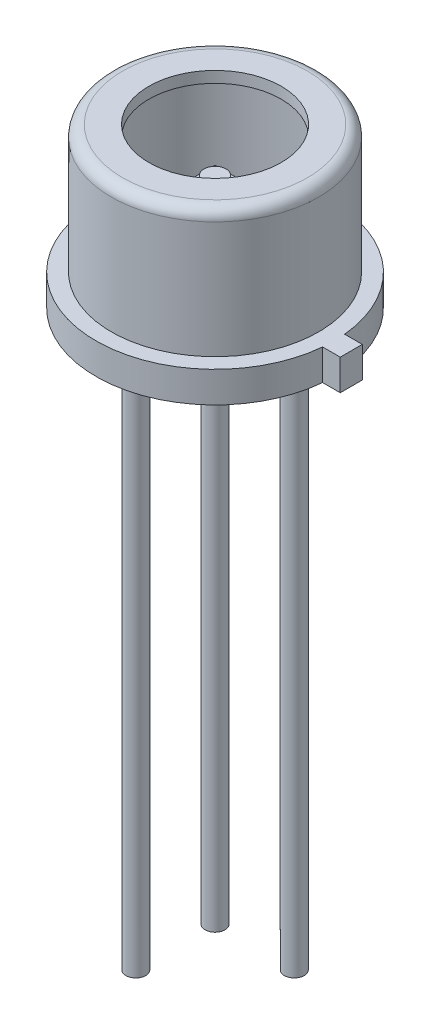
ISO-10303-21;
HEADER;
FILE_DESCRIPTION(('STEP AP214'),'2;1');
FILE_NAME('part.step','',(''),(''),'','','');
FILE_SCHEMA(('AUTOMOTIVE_DESIGN { 1 0 10303 214 1 1 1 1 }'));
ENDSEC;
DATA;
#1=APPLICATION_CONTEXT('core data for automotive mechanical design processes');
#2=APPLICATION_PROTOCOL_DEFINITION('international standard','automotive_design',2000,#1);
#3=PRODUCT_CONTEXT('',#1,'mechanical');
#4=PRODUCT('Part','Part','',(#3));
#5=PRODUCT_RELATED_PRODUCT_CATEGORY('part','',(#4));
#6=PRODUCT_DEFINITION_FORMATION('','',#4);
#7=PRODUCT_DEFINITION_CONTEXT('part definition',#1,'design');
#8=PRODUCT_DEFINITION('design','',#6,#7);
#9=PRODUCT_DEFINITION_SHAPE('','',#8);
#10=(LENGTH_UNIT() NAMED_UNIT(*) SI_UNIT(.MILLI.,.METRE.));
#11=(NAMED_UNIT(*) PLANE_ANGLE_UNIT() SI_UNIT($,.RADIAN.));
#12=(NAMED_UNIT(*) SI_UNIT($,.STERADIAN.) SOLID_ANGLE_UNIT());
#13=UNCERTAINTY_MEASURE_WITH_UNIT(LENGTH_MEASURE(1.E-05),#10,'distance_accuracy_value','');
#14=(GEOMETRIC_REPRESENTATION_CONTEXT(3) GLOBAL_UNCERTAINTY_ASSIGNED_CONTEXT((#13)) GLOBAL_UNIT_ASSIGNED_CONTEXT((#10,
#11,#12)) REPRESENTATION_CONTEXT('',''));
#15=CARTESIAN_POINT('',(0.,0.,0.));
#16=DIRECTION('',(0.,0.,1.));
#17=DIRECTION('',(1.,0.,0.));
#18=AXIS2_PLACEMENT_3D('',#15,#16,#17);
#19=CARTESIAN_POINT('',(-0.3,2.45,0.3));
#20=DIRECTION('',(1.,0.,0.));
#21=DIRECTION('',(0.,0.,-1.));
#22=AXIS2_PLACEMENT_3D('',#19,#20,#21);
#23=PLANE('',#22);
#24=DIRECTION('',(0.,0.,-1.));
#25=VECTOR('',#24,1.);
#26=CARTESIAN_POINT('',(-0.3,2.5,0.3));
#27=LINE('',#26,#25);
#28=CARTESIAN_POINT('',(-0.3,2.5,0.3));
#29=VERTEX_POINT('',#28);
#30=CARTESIAN_POINT('',(-0.299999999999999,2.5,-0.3));
#31=VERTEX_POINT('',#30);
#32=EDGE_CURVE('E110',#29,#31,#27,.T.);
#33=ORIENTED_EDGE('',*,*,#32,.T.);
#34=DIRECTION('',(0.,1.,0.));
#35=VECTOR('',#34,1.);
#36=CARTESIAN_POINT('',(-0.299999999999999,2.45,-0.3));
#37=LINE('',#36,#35);
#38=CARTESIAN_POINT('',(-0.299999999999999,2.45,-0.3));
#39=VERTEX_POINT('',#38);
#40=EDGE_CURVE('E12',#39,#31,#37,.T.);
#41=ORIENTED_EDGE('',*,*,#40,.F.);
#42=DIRECTION('',(0.,0.,-1.));
#43=VECTOR('',#42,1.);
#44=CARTESIAN_POINT('',(-0.3,2.45,0.3));
#45=LINE('',#44,#43);
#46=CARTESIAN_POINT('',(-0.3,2.45,0.3));
#47=VERTEX_POINT('',#46);
#48=EDGE_CURVE('E98',#47,#39,#45,.T.);
#49=ORIENTED_EDGE('',*,*,#48,.F.);
#50=DIRECTION('',(0.,1.,0.));
#51=VECTOR('',#50,1.);
#52=CARTESIAN_POINT('',(-0.3,2.45,0.3));
#53=LINE('',#52,#51);
#54=EDGE_CURVE('E106',#47,#29,#53,.T.);
#55=ORIENTED_EDGE('',*,*,#54,.T.);
#56=EDGE_LOOP('',(#33,#41,#49,#55));
#57=FACE_BOUND('',#56,.T.);
#58=ADVANCED_FACE('F47',(#57),#23,.F.);
#59=CARTESIAN_POINT('',(-0.299999999999999,2.45,-0.3));
#60=DIRECTION('',(0.,0.,1.));
#61=DIRECTION('',(1.,0.,0.));
#62=AXIS2_PLACEMENT_3D('',#59,#60,#61);
#63=PLANE('',#62);
#64=DIRECTION('',(1.,0.,0.));
#65=VECTOR('',#64,1.);
#66=CARTESIAN_POINT('',(-0.299999999999999,2.5,-0.3));
#67=LINE('',#66,#65);
#68=CARTESIAN_POINT('',(0.3,2.5,-0.3));
#69=VERTEX_POINT('',#68);
#70=EDGE_CURVE('E102',#31,#69,#67,.T.);
#71=ORIENTED_EDGE('',*,*,#70,.T.);
#72=DIRECTION('',(0.,1.,0.));
#73=VECTOR('',#72,1.);
#74=CARTESIAN_POINT('',(0.3,2.45,-0.3));
#75=LINE('',#74,#73);
#76=CARTESIAN_POINT('',(0.3,2.45,-0.3));
#77=VERTEX_POINT('',#76);
#78=EDGE_CURVE('E55',#77,#69,#75,.T.);
#79=ORIENTED_EDGE('',*,*,#78,.F.);
#80=DIRECTION('',(1.,0.,0.));
#81=VECTOR('',#80,1.);
#82=CARTESIAN_POINT('',(-0.299999999999999,2.45,-0.3));
#83=LINE('',#82,#81);
#84=EDGE_CURVE('E93',#39,#77,#83,.T.);
#85=ORIENTED_EDGE('',*,*,#84,.F.);
#86=ORIENTED_EDGE('',*,*,#40,.T.);
#87=EDGE_LOOP('',(#71,#79,#85,#86));
#88=FACE_BOUND('',#87,.T.);
#89=ADVANCED_FACE('F101',(#88),#63,.F.);
#90=CARTESIAN_POINT('',(0.3,2.45,0.3));
#91=DIRECTION('',(-1.,0.,0.));
#92=DIRECTION('',(0.,0.,1.));
#93=AXIS2_PLACEMENT_3D('',#90,#91,#92);
#94=PLANE('',#93);
#95=DIRECTION('',(0.,0.,1.));
#96=VECTOR('',#95,1.);
#97=CARTESIAN_POINT('',(0.3,2.5,0.3));
#98=LINE('',#97,#96);
#99=CARTESIAN_POINT('',(0.3,2.5,0.3));
#100=VERTEX_POINT('',#99);
#101=EDGE_CURVE('E80',#69,#100,#98,.T.);
#102=ORIENTED_EDGE('',*,*,#101,.T.);
#103=DIRECTION('',(0.,1.,0.));
#104=VECTOR('',#103,1.);
#105=CARTESIAN_POINT('',(0.3,2.45,0.3));
#106=LINE('',#105,#104);
#107=CARTESIAN_POINT('',(0.3,2.45,0.3));
#108=VERTEX_POINT('',#107);
#109=EDGE_CURVE('E103',#108,#100,#106,.T.);
#110=ORIENTED_EDGE('',*,*,#109,.F.);
#111=DIRECTION('',(0.,0.,1.));
#112=VECTOR('',#111,1.);
#113=CARTESIAN_POINT('',(0.3,2.45,0.3));
#114=LINE('',#113,#112);
#115=EDGE_CURVE('E96',#77,#108,#114,.T.);
#116=ORIENTED_EDGE('',*,*,#115,.F.);
#117=ORIENTED_EDGE('',*,*,#78,.T.);
#118=EDGE_LOOP('',(#102,#110,#116,#117));
#119=FACE_BOUND('',#118,.T.);
#120=ADVANCED_FACE('F104',(#119),#94,.F.);
#121=CARTESIAN_POINT('',(-0.3,2.45,0.3));
#122=DIRECTION('',(0.,0.,-1.));
#123=DIRECTION('',(-1.,0.,0.));
#124=AXIS2_PLACEMENT_3D('',#121,#122,#123);
#125=PLANE('',#124);
#126=DIRECTION('',(-1.,0.,0.));
#127=VECTOR('',#126,1.);
#128=CARTESIAN_POINT('',(-0.3,2.5,0.3));
#129=LINE('',#128,#127);
#130=EDGE_CURVE('E86',#100,#29,#129,.T.);
#131=ORIENTED_EDGE('',*,*,#130,.T.);
#132=ORIENTED_EDGE('',*,*,#54,.F.);
#133=DIRECTION('',(-1.,0.,0.));
#134=VECTOR('',#133,1.);
#135=CARTESIAN_POINT('',(-0.3,2.45,0.3));
#136=LINE('',#135,#134);
#137=EDGE_CURVE('E63',#108,#47,#136,.T.);
#138=ORIENTED_EDGE('',*,*,#137,.F.);
#139=ORIENTED_EDGE('',*,*,#109,.T.);
#140=EDGE_LOOP('',(#131,#132,#138,#139));
#141=FACE_BOUND('',#140,.T.);
#142=ADVANCED_FACE('F118',(#141),#125,.F.);
#143=CARTESIAN_POINT('',(-0.299999999999999,2.45,-0.3));
#144=DIRECTION('',(0.,-1.,0.));
#145=DIRECTION('',(0.,0.,-1.));
#146=AXIS2_PLACEMENT_3D('',#143,#144,#145);
#147=PLANE('',#146);
#148=ORIENTED_EDGE('',*,*,#48,.T.);
#149=ORIENTED_EDGE('',*,*,#84,.T.);
#150=ORIENTED_EDGE('',*,*,#115,.T.);
#151=ORIENTED_EDGE('',*,*,#137,.T.);
#152=EDGE_LOOP('',(#148,#149,#150,#151));
#153=FACE_BOUND('',#152,.T.);
#154=ADVANCED_FACE('F94',(#153),#147,.T.);
#155=CARTESIAN_POINT('',(-0.299999999999999,2.5,-0.3));
#156=DIRECTION('',(0.,-1.,0.));
#157=DIRECTION('',(0.,0.,-1.));
#158=AXIS2_PLACEMENT_3D('',#155,#156,#157);
#159=PLANE('',#158);
#160=CARTESIAN_POINT('',(0.,2.5,0.));
#161=DIRECTION('',(0.,-1.,0.));
#162=DIRECTION('',(0.,0.,-1.));
#163=AXIS2_PLACEMENT_3D('',#160,#161,#162);
#164=CIRCLE('',#163,0.25);
#165=CARTESIAN_POINT('',(0.,2.5,-0.25));
#166=VERTEX_POINT('',#165);
#167=EDGE_CURVE('E124',#166,#166,#164,.T.);
#168=ORIENTED_EDGE('',*,*,#167,.T.);
#169=EDGE_LOOP('',(#168));
#170=FACE_BOUND('',#169,.T.);
#171=ORIENTED_EDGE('',*,*,#32,.F.);
#172=ORIENTED_EDGE('',*,*,#130,.F.);
#173=ORIENTED_EDGE('',*,*,#101,.F.);
#174=ORIENTED_EDGE('',*,*,#70,.F.);
#175=EDGE_LOOP('',(#171,#172,#173,#174));
#176=FACE_BOUND('',#175,.T.);
#177=ADVANCED_FACE('F121',(#170,#176),#159,.F.);
#178=CARTESIAN_POINT('',(0.,2.6,0.));
#179=DIRECTION('',(0.,-1.,0.));
#180=DIRECTION('',(0.,0.,-1.));
#181=AXIS2_PLACEMENT_3D('',#178,#179,#180);
#182=CYLINDRICAL_SURFACE('',#181,0.25);
#183=CARTESIAN_POINT('',(0.,2.6,0.));
#184=DIRECTION('',(0.,-1.,0.));
#185=DIRECTION('',(0.,0.,-1.));
#186=AXIS2_PLACEMENT_3D('',#183,#184,#185);
#187=CIRCLE('',#186,0.25);
#188=CARTESIAN_POINT('',(0.,2.6,-0.25));
#189=VERTEX_POINT('',#188);
#190=EDGE_CURVE('E113',#189,#189,#187,.T.);
#191=ORIENTED_EDGE('',*,*,#190,.T.);
#192=EDGE_LOOP('',(#191));
#193=FACE_BOUND('',#192,.T.);
#194=ORIENTED_EDGE('',*,*,#167,.F.);
#195=EDGE_LOOP('',(#194));
#196=FACE_BOUND('',#195,.T.);
#197=ADVANCED_FACE('F130',(#193,#196),#182,.T.);
#198=CARTESIAN_POINT('',(0.,2.6,0.));
#199=DIRECTION('',(0.,-1.,0.));
#200=DIRECTION('',(0.,0.,-1.));
#201=AXIS2_PLACEMENT_3D('',#198,#199,#200);
#202=PLANE('',#201);
#203=ORIENTED_EDGE('',*,*,#190,.F.);
#204=EDGE_LOOP('',(#203));
#205=FACE_BOUND('',#204,.T.);
#206=ADVANCED_FACE('F133',(#205),#202,.F.);
#207=CLOSED_SHELL('',(#58,#89,#120,#142,#154,#177,#197,#206));
#208=MANIFOLD_SOLID_BREP('B2',#207);
#209=CARTESIAN_POINT('',(2.7,0.,0.));
#210=DIRECTION('',(0.,1.,0.));
#211=DIRECTION('',(0.,0.,1.));
#212=AXIS2_PLACEMENT_3D('',#209,#210,#211);
#213=PLANE('',#212);
#214=CARTESIAN_POINT('',(0.898025612106904,0.,-0.898025612106927));
#215=DIRECTION('',(0.,1.,0.));
#216=DIRECTION('',(0.,0.,1.));
#217=AXIS2_PLACEMENT_3D('',#214,#215,#216);
#218=CIRCLE('',#217,0.225);
#219=CARTESIAN_POINT('',(0.898025612106904,0.,-0.673025612106927));
#220=VERTEX_POINT('',#219);
#221=EDGE_CURVE('E211',#220,#220,#218,.F.);
#222=ORIENTED_EDGE('',*,*,#221,.F.);
#223=EDGE_LOOP('',(#222));
#224=FACE_BOUND('',#223,.T.);
#225=CARTESIAN_POINT('',(0.,0.,0.));
#226=DIRECTION('',(0.,-1.,0.));
#227=DIRECTION('',(0.,0.,-1.));
#228=AXIS2_PLACEMENT_3D('',#225,#226,#227);
#229=CIRCLE('',#228,2.7);
#230=CARTESIAN_POINT('',(2.68840101175401,0.,0.250000000000029));
#231=VERTEX_POINT('',#230);
#232=CARTESIAN_POINT('',(2.68840101175402,0.,-0.249999999999971));
#233=VERTEX_POINT('',#232);
#234=EDGE_CURVE('E218',#231,#233,#229,.T.);
#235=ORIENTED_EDGE('',*,*,#234,.T.);
#236=DIRECTION('',(-1.,0.,0.));
#237=VECTOR('',#236,1.);
#238=CARTESIAN_POINT('',(0.,0.,-0.250000000000001));
#239=LINE('',#238,#237);
#240=CARTESIAN_POINT('',(3.08840101175402,0.,-0.249999999999967));
#241=VERTEX_POINT('',#240);
#242=EDGE_CURVE('E268',#241,#233,#239,.T.);
#243=ORIENTED_EDGE('',*,*,#242,.F.);
#244=DIRECTION('',(0.,0.,1.));
#245=VECTOR('',#244,1.);
#246=CARTESIAN_POINT('',(3.08840101175401,0.,0.));
#247=LINE('',#246,#245);
#248=CARTESIAN_POINT('',(3.08840101175401,0.,0.250000000000033));
#249=VERTEX_POINT('',#248);
#250=EDGE_CURVE('E262',#241,#249,#247,.T.);
#251=ORIENTED_EDGE('',*,*,#250,.T.);
#252=DIRECTION('',(-1.,0.,0.));
#253=VECTOR('',#252,1.);
#254=CARTESIAN_POINT('',(0.,0.,0.250000000000001));
#255=LINE('',#254,#253);
#256=EDGE_CURVE('E260',#249,#231,#255,.T.);
#257=ORIENTED_EDGE('',*,*,#256,.T.);
#258=EDGE_LOOP('',(#235,#243,#251,#257));
#259=FACE_BOUND('',#258,.T.);
#260=CARTESIAN_POINT('',(-0.898025612106926,0.,0.898025612106904));
#261=DIRECTION('',(0.,1.,0.));
#262=DIRECTION('',(0.,0.,1.));
#263=AXIS2_PLACEMENT_3D('',#260,#261,#262);
#264=CIRCLE('',#263,0.225);
#265=CARTESIAN_POINT('',(-0.898025612106926,0.,1.1230256121069));
#266=VERTEX_POINT('',#265);
#267=EDGE_CURVE('E296',#266,#266,#264,.F.);
#268=ORIENTED_EDGE('',*,*,#267,.F.);
#269=EDGE_LOOP('',(#268));
#270=FACE_BOUND('',#269,.T.);
#271=CARTESIAN_POINT('',(-0.898025612106927,0.,-0.898025612106927));
#272=DIRECTION('',(0.,1.,0.));
#273=DIRECTION('',(0.,0.,1.));
#274=AXIS2_PLACEMENT_3D('',#271,#272,#273);
#275=CIRCLE('',#274,0.225);
#276=CARTESIAN_POINT('',(-0.898025612106927,0.,-0.673025612106927));
#277=VERTEX_POINT('',#276);
#278=EDGE_CURVE('E45',#277,#277,#275,.F.);
#279=ORIENTED_EDGE('',*,*,#278,.F.);
#280=EDGE_LOOP('',(#279));
#281=FACE_BOUND('',#280,.T.);
#282=ADVANCED_FACE('F203',(#224,#259,#270,#281),#213,.F.);
#283=CARTESIAN_POINT('',(2.096,3.6,0.));
#284=DIRECTION('',(0.,1.,0.));
#285=DIRECTION('',(0.,0.,1.));
#286=AXIS2_PLACEMENT_3D('',#283,#284,#285);
#287=PLANE('',#286);
#288=CARTESIAN_POINT('',(0.,3.6,0.));
#289=DIRECTION('',(0.,-1.,0.));
#290=DIRECTION('',(0.,0.,-1.));
#291=AXIS2_PLACEMENT_3D('',#288,#289,#290);
#292=CIRCLE('',#291,1.5);
#293=CARTESIAN_POINT('',(0.,3.6,-1.5));
#294=VERTEX_POINT('',#293);
#295=EDGE_CURVE('E293',#294,#294,#292,.T.);
#296=ORIENTED_EDGE('',*,*,#295,.T.);
#297=EDGE_LOOP('',(#296));
#298=FACE_BOUND('',#297,.T.);
#299=CARTESIAN_POINT('',(0.,3.6,0.));
#300=DIRECTION('',(0.,-1.,0.));
#301=DIRECTION('',(0.,0.,-1.));
#302=AXIS2_PLACEMENT_3D('',#299,#300,#301);
#303=CIRCLE('',#302,2.096);
#304=CARTESIAN_POINT('',(0.,3.6,-2.096));
#305=VERTEX_POINT('',#304);
#306=EDGE_CURVE('E278',#305,#305,#303,.T.);
#307=ORIENTED_EDGE('',*,*,#306,.F.);
#308=EDGE_LOOP('',(#307));
#309=FACE_BOUND('',#308,.T.);
#310=ADVANCED_FACE('F205',(#298,#309),#287,.T.);
#311=CARTESIAN_POINT('',(0.,0.,0.));
#312=DIRECTION('',(0.,-1.,0.));
#313=DIRECTION('',(0.,0.,-1.));
#314=AXIS2_PLACEMENT_3D('',#311,#312,#313);
#315=CYLINDRICAL_SURFACE('',#314,1.5);
#316=ORIENTED_EDGE('',*,*,#295,.F.);
#317=EDGE_LOOP('',(#316));
#318=FACE_BOUND('',#317,.T.);
#319=CARTESIAN_POINT('',(0.,3.346,0.));
#320=DIRECTION('',(0.,-1.,0.));
#321=DIRECTION('',(0.,0.,-1.));
#322=AXIS2_PLACEMENT_3D('',#319,#320,#321);
#323=CIRCLE('',#322,1.5);
#324=CARTESIAN_POINT('',(0.,3.346,-1.5));
#325=VERTEX_POINT('',#324);
#326=EDGE_CURVE('E290',#325,#325,#323,.T.);
#327=ORIENTED_EDGE('',*,*,#326,.T.);
#328=EDGE_LOOP('',(#327));
#329=FACE_BOUND('',#328,.T.);
#330=ADVANCED_FACE('F373',(#318,#329),#315,.F.);
#331=CARTESIAN_POINT('',(2.096,3.346,0.));
#332=DIRECTION('',(0.,1.,0.));
#333=DIRECTION('',(0.,0.,1.));
#334=AXIS2_PLACEMENT_3D('',#331,#332,#333);
#335=PLANE('',#334);
#336=ORIENTED_EDGE('',*,*,#326,.F.);
#337=EDGE_LOOP('',(#336));
#338=FACE_BOUND('',#337,.T.);
#339=CARTESIAN_POINT('',(0.,3.346,0.));
#340=DIRECTION('',(0.,-1.,0.));
#341=DIRECTION('',(0.,0.,-1.));
#342=AXIS2_PLACEMENT_3D('',#339,#340,#341);
#343=CIRCLE('',#342,2.096);
#344=CARTESIAN_POINT('',(0.,3.346,-2.096));
#345=VERTEX_POINT('',#344);
#346=EDGE_CURVE('E287',#345,#345,#343,.T.);
#347=ORIENTED_EDGE('',*,*,#346,.T.);
#348=EDGE_LOOP('',(#347));
#349=FACE_BOUND('',#348,.T.);
#350=ADVANCED_FACE('F370',(#338,#349),#335,.F.);
#351=CARTESIAN_POINT('',(0.,0.,0.));
#352=DIRECTION('',(0.,-1.,0.));
#353=DIRECTION('',(0.,0.,-1.));
#354=AXIS2_PLACEMENT_3D('',#351,#352,#353);
#355=CYLINDRICAL_SURFACE('',#354,2.096);
#356=ORIENTED_EDGE('',*,*,#346,.F.);
#357=EDGE_LOOP('',(#356));
#358=FACE_BOUND('',#357,.T.);
#359=CARTESIAN_POINT('',(0.,0.446,0.));
#360=DIRECTION('',(0.,1.,0.));
#361=DIRECTION('',(0.,0.,1.));
#362=AXIS2_PLACEMENT_3D('',#359,#360,#361);
#363=CIRCLE('',#362,2.096);
#364=CARTESIAN_POINT('',(0.,0.446,2.096));
#365=VERTEX_POINT('',#364);
#366=EDGE_CURVE('E275',#365,#365,#363,.F.);
#367=ORIENTED_EDGE('',*,*,#366,.T.);
#368=EDGE_LOOP('',(#367));
#369=FACE_BOUND('',#368,.T.);
#370=ADVANCED_FACE('F366',(#358,#369),#355,.F.);
#371=CARTESIAN_POINT('',(0.,0.,0.));
#372=DIRECTION('',(0.,-1.,0.));
#373=DIRECTION('',(0.,0.,-1.));
#374=AXIS2_PLACEMENT_3D('',#371,#372,#373);
#375=CYLINDRICAL_SURFACE('',#374,2.7);
#376=DIRECTION('',(0.,-1.,0.));
#377=VECTOR('',#376,1.);
#378=CARTESIAN_POINT('',(2.68840101175401,1.34031242374329,0.250000000000029));
#379=LINE('',#378,#377);
#380=CARTESIAN_POINT('',(2.68840101175401,0.7,0.250000000000029));
#381=VERTEX_POINT('',#380);
#382=EDGE_CURVE('E251',#381,#231,#379,.T.);
#383=ORIENTED_EDGE('',*,*,#382,.F.);
#384=CARTESIAN_POINT('',(0.,0.7,0.));
#385=DIRECTION('',(0.,-1.,0.));
#386=DIRECTION('',(0.,0.,-1.));
#387=AXIS2_PLACEMENT_3D('',#384,#385,#386);
#388=CIRCLE('',#387,2.7);
#389=CARTESIAN_POINT('',(2.68840101175402,0.7,-0.249999999999971));
#390=VERTEX_POINT('',#389);
#391=EDGE_CURVE('E242',#381,#390,#388,.T.);
#392=ORIENTED_EDGE('',*,*,#391,.T.);
#393=DIRECTION('',(0.,-1.,0.));
#394=VECTOR('',#393,1.);
#395=CARTESIAN_POINT('',(2.68840101175402,1.34031242374329,-0.249999999999971));
#396=LINE('',#395,#394);
#397=EDGE_CURVE('E223',#390,#233,#396,.T.);
#398=ORIENTED_EDGE('',*,*,#397,.T.);
#399=ORIENTED_EDGE('',*,*,#234,.F.);
#400=EDGE_LOOP('',(#383,#392,#398,#399));
#401=FACE_BOUND('',#400,.T.);
#402=ADVANCED_FACE('F252',(#401),#375,.T.);
#403=CARTESIAN_POINT('',(2.7,0.7,0.));
#404=DIRECTION('',(0.,1.,0.));
#405=DIRECTION('',(0.,0.,1.));
#406=AXIS2_PLACEMENT_3D('',#403,#404,#405);
#407=PLANE('',#406);
#408=CARTESIAN_POINT('',(0.,0.7,0.));
#409=DIRECTION('',(0.,-1.,0.));
#410=DIRECTION('',(0.,0.,-1.));
#411=AXIS2_PLACEMENT_3D('',#408,#409,#410);
#412=CIRCLE('',#411,2.35);
#413=CARTESIAN_POINT('',(0.,0.7,-2.35));
#414=VERTEX_POINT('',#413);
#415=EDGE_CURVE('E249',#414,#414,#412,.T.);
#416=ORIENTED_EDGE('',*,*,#415,.T.);
#417=EDGE_LOOP('',(#416));
#418=FACE_BOUND('',#417,.T.);
#419=ORIENTED_EDGE('',*,*,#391,.F.);
#420=DIRECTION('',(-1.,0.,0.));
#421=VECTOR('',#420,1.);
#422=CARTESIAN_POINT('',(0.,0.7,0.250000000000001));
#423=LINE('',#422,#421);
#424=CARTESIAN_POINT('',(3.08840101175401,0.7,0.250000000000033));
#425=VERTEX_POINT('',#424);
#426=EDGE_CURVE('E245',#425,#381,#423,.T.);
#427=ORIENTED_EDGE('',*,*,#426,.F.);
#428=DIRECTION('',(0.,0.,1.));
#429=VECTOR('',#428,1.);
#430=CARTESIAN_POINT('',(3.08840101175401,0.7,0.));
#431=LINE('',#430,#429);
#432=CARTESIAN_POINT('',(3.08840101175402,0.7,-0.249999999999967));
#433=VERTEX_POINT('',#432);
#434=EDGE_CURVE('E266',#433,#425,#431,.T.);
#435=ORIENTED_EDGE('',*,*,#434,.F.);
#436=DIRECTION('',(-1.,0.,0.));
#437=VECTOR('',#436,1.);
#438=CARTESIAN_POINT('',(0.,0.7,-0.250000000000001));
#439=LINE('',#438,#437);
#440=EDGE_CURVE('E248',#433,#390,#439,.T.);
#441=ORIENTED_EDGE('',*,*,#440,.T.);
#442=EDGE_LOOP('',(#419,#427,#435,#441));
#443=FACE_BOUND('',#442,.T.);
#444=ADVANCED_FACE('F243',(#418,#443),#407,.T.);
#445=CARTESIAN_POINT('',(0.,0.,0.));
#446=DIRECTION('',(0.,-1.,0.));
#447=DIRECTION('',(0.,0.,-1.));
#448=AXIS2_PLACEMENT_3D('',#445,#446,#447);
#449=CYLINDRICAL_SURFACE('',#448,2.35);
#450=CARTESIAN_POINT('',(0.,3.346,0.));
#451=DIRECTION('',(0.,-1.,0.));
#452=DIRECTION('',(0.,0.,-1.));
#453=AXIS2_PLACEMENT_3D('',#450,#451,#452);
#454=CIRCLE('',#453,2.35);
#455=CARTESIAN_POINT('',(0.,3.346,-2.35));
#456=VERTEX_POINT('',#455);
#457=EDGE_CURVE('E281',#456,#456,#454,.T.);
#458=ORIENTED_EDGE('',*,*,#457,.T.);
#459=EDGE_LOOP('',(#458));
#460=FACE_BOUND('',#459,.T.);
#461=ORIENTED_EDGE('',*,*,#415,.F.);
#462=EDGE_LOOP('',(#461));
#463=FACE_BOUND('',#462,.T.);
#464=ADVANCED_FACE('F357',(#460,#463),#449,.T.);
#465=CARTESIAN_POINT('',(0.,3.346,0.));
#466=DIRECTION('',(0.,-1.,0.));
#467=DIRECTION('',(0.,0.,-1.));
#468=AXIS2_PLACEMENT_3D('',#465,#466,#467);
#469=TOROIDAL_SURFACE('',#468,2.096,0.254);
#470=ORIENTED_EDGE('',*,*,#306,.T.);
#471=EDGE_LOOP('',(#470));
#472=FACE_BOUND('',#471,.T.);
#473=ORIENTED_EDGE('',*,*,#457,.F.);
#474=EDGE_LOOP('',(#473));
#475=FACE_BOUND('',#474,.T.);
#476=ADVANCED_FACE('F353',(#472,#475),#469,.T.);
#477=CARTESIAN_POINT('',(2.7,0.446,0.));
#478=DIRECTION('',(0.,1.,0.));
#479=DIRECTION('',(0.,0.,1.));
#480=AXIS2_PLACEMENT_3D('',#477,#478,#479);
#481=PLANE('',#480);
#482=ORIENTED_EDGE('',*,*,#366,.F.);
#483=EDGE_LOOP('',(#482));
#484=FACE_BOUND('',#483,.T.);
#485=ADVANCED_FACE('F350',(#484),#481,.T.);
#486=CARTESIAN_POINT('',(0.,1.34031242374329,0.250000000000001));
#487=DIRECTION('',(0.,0.,1.));
#488=DIRECTION('',(1.,0.,0.));
#489=AXIS2_PLACEMENT_3D('',#486,#487,#488);
#490=PLANE('',#489);
#491=DIRECTION('',(0.,-1.,0.));
#492=VECTOR('',#491,1.);
#493=CARTESIAN_POINT('',(3.08840101175401,1.34031242374329,0.250000000000033));
#494=LINE('',#493,#492);
#495=EDGE_CURVE('E259',#425,#249,#494,.T.);
#496=ORIENTED_EDGE('',*,*,#495,.F.);
#497=ORIENTED_EDGE('',*,*,#426,.T.);
#498=ORIENTED_EDGE('',*,*,#382,.T.);
#499=ORIENTED_EDGE('',*,*,#256,.F.);
#500=EDGE_LOOP('',(#496,#497,#498,#499));
#501=FACE_BOUND('',#500,.T.);
#502=ADVANCED_FACE('F258',(#501),#490,.T.);
#503=CARTESIAN_POINT('',(0.,1.34031242374329,-0.250000000000001));
#504=DIRECTION('',(0.,0.,1.));
#505=DIRECTION('',(1.,0.,0.));
#506=AXIS2_PLACEMENT_3D('',#503,#504,#505);
#507=PLANE('',#506);
#508=ORIENTED_EDGE('',*,*,#440,.F.);
#509=DIRECTION('',(0.,-1.,0.));
#510=VECTOR('',#509,1.);
#511=CARTESIAN_POINT('',(3.08840101175402,1.34031242374329,-0.249999999999967));
#512=LINE('',#511,#510);
#513=EDGE_CURVE('E271',#433,#241,#512,.T.);
#514=ORIENTED_EDGE('',*,*,#513,.T.);
#515=ORIENTED_EDGE('',*,*,#242,.T.);
#516=ORIENTED_EDGE('',*,*,#397,.F.);
#517=EDGE_LOOP('',(#508,#514,#515,#516));
#518=FACE_BOUND('',#517,.T.);
#519=ADVANCED_FACE('F343',(#518),#507,.F.);
#520=CARTESIAN_POINT('',(3.08840101175401,1.34031242374329,0.));
#521=DIRECTION('',(1.,0.,0.));
#522=DIRECTION('',(0.,0.,-1.));
#523=AXIS2_PLACEMENT_3D('',#520,#521,#522);
#524=PLANE('',#523);
#525=ORIENTED_EDGE('',*,*,#513,.F.);
#526=ORIENTED_EDGE('',*,*,#434,.T.);
#527=ORIENTED_EDGE('',*,*,#495,.T.);
#528=ORIENTED_EDGE('',*,*,#250,.F.);
#529=EDGE_LOOP('',(#525,#526,#527,#528));
#530=FACE_BOUND('',#529,.T.);
#531=ADVANCED_FACE('F339',(#530),#524,.T.);
#532=CARTESIAN_POINT('',(-0.898025612106926,-13.,0.898025612106904));
#533=DIRECTION('',(0.,1.,0.));
#534=DIRECTION('',(0.,0.,1.));
#535=AXIS2_PLACEMENT_3D('',#532,#533,#534);
#536=CYLINDRICAL_SURFACE('',#535,0.225);
#537=CARTESIAN_POINT('',(-0.898025612106926,-13.,0.898025612106904));
#538=DIRECTION('',(0.,-1.,0.));
#539=DIRECTION('',(0.,0.,-1.));
#540=AXIS2_PLACEMENT_3D('',#537,#538,#539);
#541=CIRCLE('',#540,0.225);
#542=CARTESIAN_POINT('',(-0.898025612106926,-13.,0.673025612106904));
#543=VERTEX_POINT('',#542);
#544=EDGE_CURVE('E270',#543,#543,#541,.T.);
#545=ORIENTED_EDGE('',*,*,#544,.F.);
#546=EDGE_LOOP('',(#545));
#547=FACE_BOUND('',#546,.T.);
#548=ORIENTED_EDGE('',*,*,#267,.T.);
#549=EDGE_LOOP('',(#548));
#550=FACE_BOUND('',#549,.T.);
#551=ADVANCED_FACE('F335',(#547,#550),#536,.T.);
#552=CARTESIAN_POINT('',(-0.898025612106926,-13.,0.898025612106904));
#553=DIRECTION('',(0.,-1.,0.));
#554=DIRECTION('',(0.,0.,-1.));
#555=AXIS2_PLACEMENT_3D('',#552,#553,#554);
#556=PLANE('',#555);
#557=ORIENTED_EDGE('',*,*,#544,.T.);
#558=EDGE_LOOP('',(#557));
#559=FACE_BOUND('',#558,.T.);
#560=ADVANCED_FACE('F331',(#559),#556,.T.);
#561=CARTESIAN_POINT('',(0.898025612106904,-13.,-0.898025612106927));
#562=DIRECTION('',(0.,1.,0.));
#563=DIRECTION('',(0.,0.,1.));
#564=AXIS2_PLACEMENT_3D('',#561,#562,#563);
#565=CYLINDRICAL_SURFACE('',#564,0.225);
#566=CARTESIAN_POINT('',(0.898025612106904,-13.,-0.898025612106927));
#567=DIRECTION('',(0.,-1.,0.));
#568=DIRECTION('',(0.,0.,-1.));
#569=AXIS2_PLACEMENT_3D('',#566,#567,#568);
#570=CIRCLE('',#569,0.225);
#571=CARTESIAN_POINT('',(0.898025612106904,-13.,-1.12302561210693));
#572=VERTEX_POINT('',#571);
#573=EDGE_CURVE('E525',#572,#572,#570,.T.);
#574=ORIENTED_EDGE('',*,*,#573,.F.);
#575=EDGE_LOOP('',(#574));
#576=FACE_BOUND('',#575,.T.);
#577=ORIENTED_EDGE('',*,*,#221,.T.);
#578=EDGE_LOOP('',(#577));
#579=FACE_BOUND('',#578,.T.);
#580=ADVANCED_FACE('F301',(#576,#579),#565,.T.);
#581=CARTESIAN_POINT('',(0.898025612106904,-13.,-0.898025612106927));
#582=DIRECTION('',(0.,-1.,0.));
#583=DIRECTION('',(0.,0.,-1.));
#584=AXIS2_PLACEMENT_3D('',#581,#582,#583);
#585=PLANE('',#584);
#586=ORIENTED_EDGE('',*,*,#573,.T.);
#587=EDGE_LOOP('',(#586));
#588=FACE_BOUND('',#587,.T.);
#589=ADVANCED_FACE('F316',(#588),#585,.T.);
#590=CARTESIAN_POINT('',(-0.898025612106927,-13.,-0.898025612106927));
#591=DIRECTION('',(0.,1.,0.));
#592=DIRECTION('',(0.,0.,1.));
#593=AXIS2_PLACEMENT_3D('',#590,#591,#592);
#594=CYLINDRICAL_SURFACE('',#593,0.225);
#595=CARTESIAN_POINT('',(-0.898025612106927,-13.,-0.898025612106927));
#596=DIRECTION('',(0.,-1.,0.));
#597=DIRECTION('',(0.,0.,-1.));
#598=AXIS2_PLACEMENT_3D('',#595,#596,#597);
#599=CIRCLE('',#598,0.225);
#600=CARTESIAN_POINT('',(-0.898025612106927,-13.,-1.12302561210693));
#601=VERTEX_POINT('',#600);
#602=EDGE_CURVE('E528',#601,#601,#599,.T.);
#603=ORIENTED_EDGE('',*,*,#602,.F.);
#604=EDGE_LOOP('',(#603));
#605=FACE_BOUND('',#604,.T.);
#606=ORIENTED_EDGE('',*,*,#278,.T.);
#607=EDGE_LOOP('',(#606));
#608=FACE_BOUND('',#607,.T.);
#609=ADVANCED_FACE('F313',(#605,#608),#594,.T.);
#610=CARTESIAN_POINT('',(-0.898025612106927,-13.,-0.898025612106927));
#611=DIRECTION('',(0.,-1.,0.));
#612=DIRECTION('',(0.,0.,-1.));
#613=AXIS2_PLACEMENT_3D('',#610,#611,#612);
#614=PLANE('',#613);
#615=ORIENTED_EDGE('',*,*,#602,.T.);
#616=EDGE_LOOP('',(#615));
#617=FACE_BOUND('',#616,.T.);
#618=ADVANCED_FACE('F315',(#617),#614,.T.);
#619=CLOSED_SHELL('',(#282,#310,#330,#350,#370,#402,#444,#464,#476,#485,#502,#519,#531,#551,
#560,#580,#589,#609,#618));
#620=MANIFOLD_SOLID_BREP('B6',#619);
#621=ADVANCED_BREP_SHAPE_REPRESENTATION('',(#18,#208,#620),#14);
#622=SHAPE_DEFINITION_REPRESENTATION(#9,#621);
ENDSEC;
END-ISO-10303-21;
